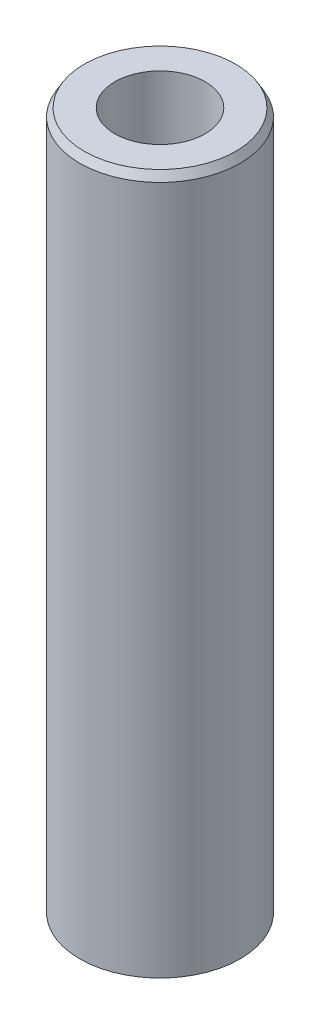
ISO-10303-21;
HEADER;
FILE_DESCRIPTION(('STEP AP214'),'2;1');
FILE_NAME('part.step','',(''),(''),'','','');
FILE_SCHEMA(('AUTOMOTIVE_DESIGN { 1 0 10303 214 1 1 1 1 }'));
ENDSEC;
DATA;
#1=APPLICATION_CONTEXT('core data for automotive mechanical design processes');
#2=APPLICATION_PROTOCOL_DEFINITION('international standard','automotive_design',2000,#1);
#3=PRODUCT_CONTEXT('',#1,'mechanical');
#4=PRODUCT('Part','Part','',(#3));
#5=PRODUCT_RELATED_PRODUCT_CATEGORY('part','',(#4));
#6=PRODUCT_DEFINITION_FORMATION('','',#4);
#7=PRODUCT_DEFINITION_CONTEXT('part definition',#1,'design');
#8=PRODUCT_DEFINITION('design','',#6,#7);
#9=PRODUCT_DEFINITION_SHAPE('','',#8);
#10=(LENGTH_UNIT() NAMED_UNIT(*) SI_UNIT(.MILLI.,.METRE.));
#11=(NAMED_UNIT(*) PLANE_ANGLE_UNIT() SI_UNIT($,.RADIAN.));
#12=(NAMED_UNIT(*) SI_UNIT($,.STERADIAN.) SOLID_ANGLE_UNIT());
#13=UNCERTAINTY_MEASURE_WITH_UNIT(LENGTH_MEASURE(1.E-05),#10,'distance_accuracy_value','');
#14=(GEOMETRIC_REPRESENTATION_CONTEXT(3) GLOBAL_UNCERTAINTY_ASSIGNED_CONTEXT((#13)) GLOBAL_UNIT_ASSIGNED_CONTEXT((#10,
#11,#12)) REPRESENTATION_CONTEXT('',''));
#15=CARTESIAN_POINT('',(0.,0.,0.));
#16=DIRECTION('',(0.,0.,1.));
#17=DIRECTION('',(1.,0.,0.));
#18=AXIS2_PLACEMENT_3D('',#15,#16,#17);
#19=CARTESIAN_POINT('',(0.,349.717740527542,0.));
#20=DIRECTION('',(0.,-1.,0.));
#21=DIRECTION('',(0.,0.,-1.));
#22=AXIS2_PLACEMENT_3D('',#19,#20,#21);
#23=CYLINDRICAL_SURFACE('',#22,40.);
#24=CARTESIAN_POINT('',(0.,345.738876990852,0.));
#25=DIRECTION('',(0.,1.,0.));
#26=DIRECTION('',(0.,0.,1.));
#27=AXIS2_PLACEMENT_3D('',#24,#25,#26);
#28=CIRCLE('',#27,40.);
#29=CARTESIAN_POINT('',(0.,345.738876990852,40.));
#30=VERTEX_POINT('',#29);
#31=EDGE_CURVE('E50',#30,#30,#28,.F.);
#32=ORIENTED_EDGE('',*,*,#31,.T.);
#33=EDGE_LOOP('',(#32));
#34=FACE_BOUND('',#33,.T.);
#35=CARTESIAN_POINT('',(0.,2.2971979339767,0.));
#36=DIRECTION('',(0.,1.,0.));
#37=DIRECTION('',(0.,0.,1.));
#38=AXIS2_PLACEMENT_3D('',#35,#36,#37);
#39=CIRCLE('',#38,40.);
#40=CARTESIAN_POINT('',(0.,2.2971979339767,40.));
#41=VERTEX_POINT('',#40);
#42=EDGE_CURVE('E51',#41,#41,#39,.T.);
#43=ORIENTED_EDGE('',*,*,#42,.T.);
#44=EDGE_LOOP('',(#43));
#45=FACE_BOUND('',#44,.T.);
#46=ADVANCED_FACE('F39',(#34,#45),#23,.T.);
#47=CARTESIAN_POINT('',(0.,349.717740527542,0.));
#48=DIRECTION('',(0.,1.,0.));
#49=DIRECTION('',(0.,0.,1.));
#50=AXIS2_PLACEMENT_3D('',#47,#48,#49);
#51=PLANE('',#50);
#52=CARTESIAN_POINT('',(0.,349.717740527542,0.));
#53=DIRECTION('',(0.,1.,0.));
#54=DIRECTION('',(0.,0.,1.));
#55=AXIS2_PLACEMENT_3D('',#52,#53,#54);
#56=CIRCLE('',#55,37.7028020660232);
#57=CARTESIAN_POINT('',(0.,349.717740527542,37.7028020660232));
#58=VERTEX_POINT('',#57);
#59=EDGE_CURVE('E54',#58,#58,#56,.T.);
#60=ORIENTED_EDGE('',*,*,#59,.T.);
#61=EDGE_LOOP('',(#60));
#62=FACE_BOUND('',#61,.T.);
#63=CARTESIAN_POINT('',(0.,349.717740527542,0.));
#64=DIRECTION('',(0.,1.,0.));
#65=DIRECTION('',(0.,0.,1.));
#66=AXIS2_PLACEMENT_3D('',#63,#64,#65);
#67=CIRCLE('',#66,22.4991473689662);
#68=CARTESIAN_POINT('',(0.,349.717740527542,22.4991473689662));
#69=VERTEX_POINT('',#68);
#70=EDGE_CURVE('E58',#69,#69,#67,.T.);
#71=ORIENTED_EDGE('',*,*,#70,.F.);
#72=EDGE_LOOP('',(#71));
#73=FACE_BOUND('',#72,.T.);
#74=ADVANCED_FACE('F69',(#62,#73),#51,.T.);
#75=CARTESIAN_POINT('',(0.,0.,0.));
#76=DIRECTION('',(0.,1.,0.));
#77=DIRECTION('',(0.,0.,1.));
#78=AXIS2_PLACEMENT_3D('',#75,#76,#77);
#79=PLANE('',#78);
#80=CARTESIAN_POINT('',(0.,0.,0.));
#81=DIRECTION('',(0.,1.,0.));
#82=DIRECTION('',(0.,0.,1.));
#83=AXIS2_PLACEMENT_3D('',#80,#81,#82);
#84=CIRCLE('',#83,36.02113646331);
#85=CARTESIAN_POINT('',(0.,0.,36.02113646331));
#86=VERTEX_POINT('',#85);
#87=EDGE_CURVE('E10',#86,#86,#84,.F.);
#88=ORIENTED_EDGE('',*,*,#87,.T.);
#89=EDGE_LOOP('',(#88));
#90=FACE_BOUND('',#89,.T.);
#91=CARTESIAN_POINT('',(0.,0.,0.));
#92=DIRECTION('',(0.,1.,0.));
#93=DIRECTION('',(0.,0.,1.));
#94=AXIS2_PLACEMENT_3D('',#91,#92,#93);
#95=CIRCLE('',#94,22.4991473689662);
#96=CARTESIAN_POINT('',(0.,0.,22.4991473689662));
#97=VERTEX_POINT('',#96);
#98=EDGE_CURVE('E63',#97,#97,#95,.T.);
#99=ORIENTED_EDGE('',*,*,#98,.T.);
#100=EDGE_LOOP('',(#99));
#101=FACE_BOUND('',#100,.T.);
#102=ADVANCED_FACE('F75',(#90,#101),#79,.F.);
#103=CARTESIAN_POINT('',(0.,349.717740527542,0.));
#104=DIRECTION('',(0.,-1.,0.));
#105=DIRECTION('',(0.,0.,-1.));
#106=AXIS2_PLACEMENT_3D('',#103,#104,#105);
#107=CYLINDRICAL_SURFACE('',#106,22.4991473689662);
#108=ORIENTED_EDGE('',*,*,#70,.T.);
#109=EDGE_LOOP('',(#108));
#110=FACE_BOUND('',#109,.T.);
#111=ORIENTED_EDGE('',*,*,#98,.F.);
#112=EDGE_LOOP('',(#111));
#113=FACE_BOUND('',#112,.T.);
#114=ADVANCED_FACE('F70',(#110,#113),#107,.F.);
#115=CARTESIAN_POINT('',(0.,349.717740527542,0.));
#116=DIRECTION('',(0.,-1.,0.));
#117=DIRECTION('',(0.,0.,-1.));
#118=AXIS2_PLACEMENT_3D('',#115,#116,#117);
#119=CONICAL_SURFACE('',#118,37.7028020660232,0.523598775598294);
#120=ORIENTED_EDGE('',*,*,#31,.F.);
#121=EDGE_LOOP('',(#120));
#122=FACE_BOUND('',#121,.T.);
#123=ORIENTED_EDGE('',*,*,#59,.F.);
#124=EDGE_LOOP('',(#123));
#125=FACE_BOUND('',#124,.T.);
#126=ADVANCED_FACE('F81',(#122,#125),#119,.T.);
#127=CARTESIAN_POINT('',(0.,2.2971979339767,0.));
#128=DIRECTION('',(0.,1.,0.));
#129=DIRECTION('',(0.,0.,1.));
#130=AXIS2_PLACEMENT_3D('',#127,#128,#129);
#131=CONICAL_SURFACE('',#130,40.,1.04719755119661);
#132=ORIENTED_EDGE('',*,*,#87,.F.);
#133=EDGE_LOOP('',(#132));
#134=FACE_BOUND('',#133,.T.);
#135=ORIENTED_EDGE('',*,*,#42,.F.);
#136=EDGE_LOOP('',(#135));
#137=FACE_BOUND('',#136,.T.);
#138=ADVANCED_FACE('F45',(#134,#137),#131,.T.);
#139=CLOSED_SHELL('',(#46,#74,#102,#114,#126,#138));
#140=MANIFOLD_SOLID_BREP('B2',#139);
#141=ADVANCED_BREP_SHAPE_REPRESENTATION('',(#18,#140),#14);
#142=SHAPE_DEFINITION_REPRESENTATION(#9,#141);
ENDSEC;
END-ISO-10303-21;
